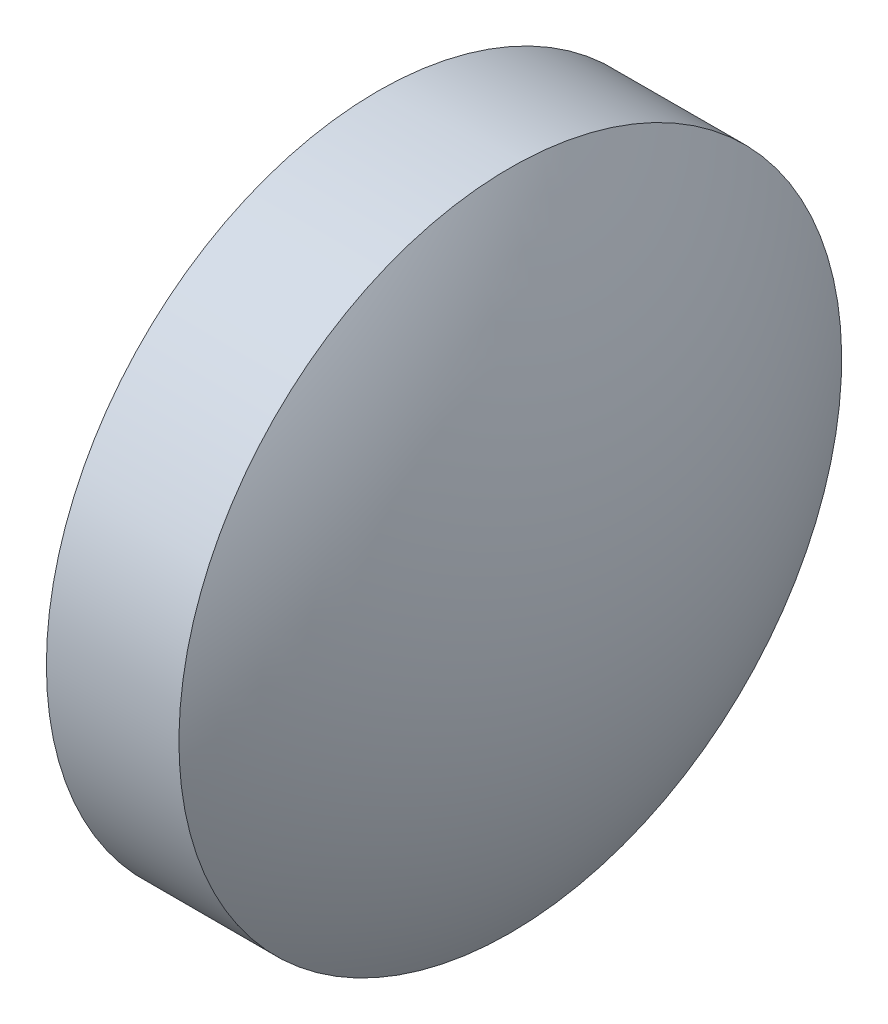
ISO-10303-21;
HEADER;
FILE_DESCRIPTION(('STEP AP214'),'2;1');
FILE_NAME('part.step','',(''),(''),'','','');
FILE_SCHEMA(('AUTOMOTIVE_DESIGN { 1 0 10303 214 1 1 1 1 }'));
ENDSEC;
DATA;
#1=APPLICATION_CONTEXT('core data for automotive mechanical design processes');
#2=APPLICATION_PROTOCOL_DEFINITION('international standard','automotive_design',2000,#1);
#3=PRODUCT_CONTEXT('',#1,'mechanical');
#4=PRODUCT('Part','Part','',(#3));
#5=PRODUCT_RELATED_PRODUCT_CATEGORY('part','',(#4));
#6=PRODUCT_DEFINITION_FORMATION('','',#4);
#7=PRODUCT_DEFINITION_CONTEXT('part definition',#1,'design');
#8=PRODUCT_DEFINITION('design','',#6,#7);
#9=PRODUCT_DEFINITION_SHAPE('','',#8);
#10=(LENGTH_UNIT() NAMED_UNIT(*) SI_UNIT(.MILLI.,.METRE.));
#11=(NAMED_UNIT(*) PLANE_ANGLE_UNIT() SI_UNIT($,.RADIAN.));
#12=(NAMED_UNIT(*) SI_UNIT($,.STERADIAN.) SOLID_ANGLE_UNIT());
#13=UNCERTAINTY_MEASURE_WITH_UNIT(LENGTH_MEASURE(1.E-05),#10,'distance_accuracy_value','');
#14=(GEOMETRIC_REPRESENTATION_CONTEXT(3) GLOBAL_UNCERTAINTY_ASSIGNED_CONTEXT((#13)) GLOBAL_UNIT_ASSIGNED_CONTEXT((#10,
#11,#12)) REPRESENTATION_CONTEXT('',''));
#15=CARTESIAN_POINT('',(0.,0.,0.));
#16=DIRECTION('',(0.,0.,1.));
#17=DIRECTION('',(1.,0.,0.));
#18=AXIS2_PLACEMENT_3D('',#15,#16,#17);
#19=CARTESIAN_POINT('',(41.0319603601307,19.1402019776318,0.));
#20=DIRECTION('',(-1.,0.,0.));
#21=DIRECTION('',(0.,1.,0.));
#22=AXIS2_PLACEMENT_3D('',#19,#20,#21);
#23=SPHERICAL_SURFACE('',#22,9.42830139372819);
#24=CARTESIAN_POINT('',(33.0386589664026,19.1402019776318,0.));
#25=DIRECTION('',(-1.,0.,0.));
#26=DIRECTION('',(0.,-1.,0.));
#27=AXIS2_PLACEMENT_3D('',#24,#25,#26);
#28=CIRCLE('',#27,5.00000000000001);
#29=CARTESIAN_POINT('',(33.0386589664026,14.1402019776318,0.));
#30=VERTEX_POINT('',#29);
#31=EDGE_CURVE('E41',#30,#30,#28,.T.);
#32=ORIENTED_EDGE('',*,*,#31,.T.);
#33=EDGE_LOOP('',(#32));
#34=FACE_BOUND('',#33,.T.);
#35=ADVANCED_FACE('F35',(#34),#23,.T.);
#36=CARTESIAN_POINT('',(27.0453575726742,19.1402019776318,0.));
#37=DIRECTION('',(-1.,0.,0.));
#38=DIRECTION('',(0.,-1.,0.));
#39=AXIS2_PLACEMENT_3D('',#36,#37,#38);
#40=SPHERICAL_SURFACE('',#39,9.42830139372831);
#41=CARTESIAN_POINT('',(35.0386589664026,19.1402019776318,0.));
#42=DIRECTION('',(-1.,0.,0.));
#43=DIRECTION('',(0.,-1.,0.));
#44=AXIS2_PLACEMENT_3D('',#41,#42,#43);
#45=CIRCLE('',#44,5.);
#46=CARTESIAN_POINT('',(35.0386589664026,14.1402019776318,0.));
#47=VERTEX_POINT('',#46);
#48=EDGE_CURVE('E10',#47,#47,#45,.T.);
#49=ORIENTED_EDGE('',*,*,#48,.F.);
#50=EDGE_LOOP('',(#49));
#51=FACE_BOUND('',#50,.T.);
#52=ADVANCED_FACE('F50',(#51),#40,.T.);
#53=CARTESIAN_POINT('',(27.0453575726742,19.1402019776318,0.));
#54=DIRECTION('',(-1.,0.,0.));
#55=DIRECTION('',(0.,-1.,0.));
#56=AXIS2_PLACEMENT_3D('',#53,#54,#55);
#57=CYLINDRICAL_SURFACE('',#56,5.);
#58=ORIENTED_EDGE('',*,*,#48,.T.);
#59=EDGE_LOOP('',(#58));
#60=FACE_BOUND('',#59,.T.);
#61=ORIENTED_EDGE('',*,*,#31,.F.);
#62=EDGE_LOOP('',(#61));
#63=FACE_BOUND('',#62,.T.);
#64=ADVANCED_FACE('F48',(#60,#63),#57,.T.);
#65=CLOSED_SHELL('',(#35,#52,#64));
#66=MANIFOLD_SOLID_BREP('B2',#65);
#67=ADVANCED_BREP_SHAPE_REPRESENTATION('',(#18,#66),#14);
#68=SHAPE_DEFINITION_REPRESENTATION(#9,#67);
ENDSEC;
END-ISO-10303-21;
